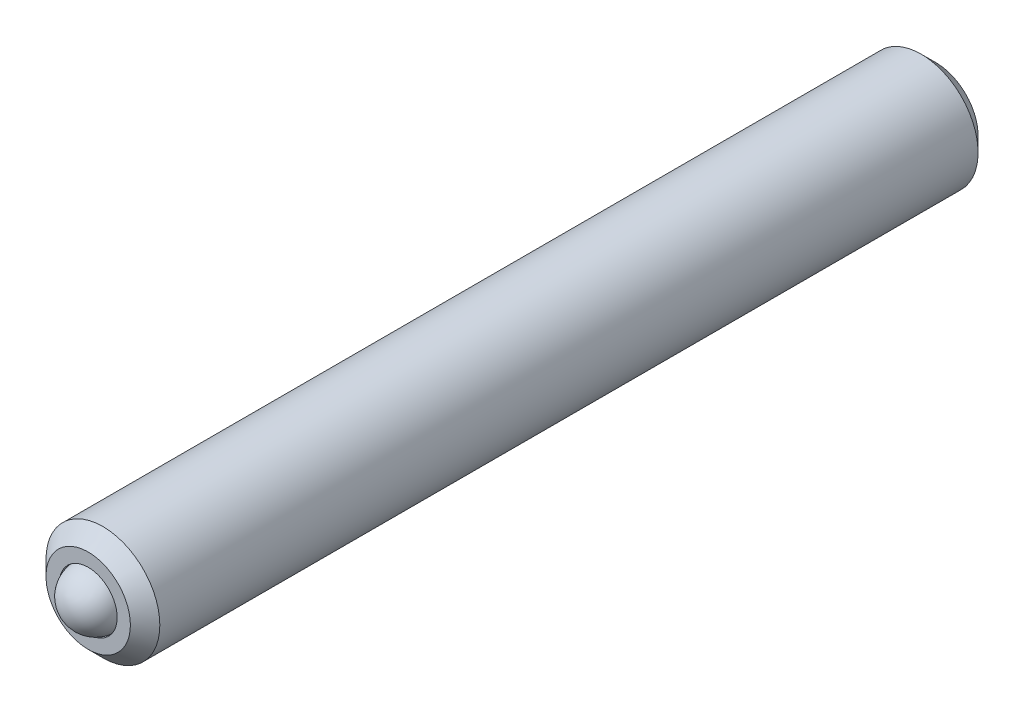
ISO-10303-21;
HEADER;
FILE_DESCRIPTION(('STEP AP214'),'2;1');
FILE_NAME('part.step','',(''),(''),'','','');
FILE_SCHEMA(('AUTOMOTIVE_DESIGN { 1 0 10303 214 1 1 1 1 }'));
ENDSEC;
DATA;
#1=APPLICATION_CONTEXT('core data for automotive mechanical design processes');
#2=APPLICATION_PROTOCOL_DEFINITION('international standard','automotive_design',2000,#1);
#3=PRODUCT_CONTEXT('',#1,'mechanical');
#4=PRODUCT('Part','Part','',(#3));
#5=PRODUCT_RELATED_PRODUCT_CATEGORY('part','',(#4));
#6=PRODUCT_DEFINITION_FORMATION('','',#4);
#7=PRODUCT_DEFINITION_CONTEXT('part definition',#1,'design');
#8=PRODUCT_DEFINITION('design','',#6,#7);
#9=PRODUCT_DEFINITION_SHAPE('','',#8);
#10=(LENGTH_UNIT() NAMED_UNIT(*) SI_UNIT(.MILLI.,.METRE.));
#11=(NAMED_UNIT(*) PLANE_ANGLE_UNIT() SI_UNIT($,.RADIAN.));
#12=(NAMED_UNIT(*) SI_UNIT($,.STERADIAN.) SOLID_ANGLE_UNIT());
#13=UNCERTAINTY_MEASURE_WITH_UNIT(LENGTH_MEASURE(1.E-05),#10,'distance_accuracy_value','');
#14=(GEOMETRIC_REPRESENTATION_CONTEXT(3) GLOBAL_UNCERTAINTY_ASSIGNED_CONTEXT((#13)) GLOBAL_UNIT_ASSIGNED_CONTEXT((#10,
#11,#12)) REPRESENTATION_CONTEXT('',''));
#15=CARTESIAN_POINT('',(0.,0.,0.));
#16=DIRECTION('',(0.,0.,1.));
#17=DIRECTION('',(1.,0.,0.));
#18=AXIS2_PLACEMENT_3D('',#15,#16,#17);
#19=CARTESIAN_POINT('',(-30.4343898565094,-20.338985797423,37.096003949472));
#20=DIRECTION('',(0.189520342345768,-0.689525578485639,-0.69902540472517));
#21=DIRECTION('',(0.0573888609944846,0.718489669689452,-0.693166006944439));
#22=AXIS2_PLACEMENT_3D('',#19,#20,#21);
#23=SPHERICAL_SURFACE('',#22,0.5);
#24=CARTESIAN_POINT('',(-30.3396296853365,-20.6837485866658,36.7464912471095));
#25=VERTEX_POINT('',#24);
#26=VERTEX_LOOP('',#25);
#27=FACE_BOUND('',#26,.T.);
#28=ADVANCED_FACE('P0_F11',(#27),#23,.T.);
#29=CLOSED_SHELL('',(#28));
#30=MANIFOLD_SOLID_BREP('P0_B1',#29);
#31=CARTESIAN_POINT('',(-30.4343898565094,-20.338985797423,37.223003949472));
#32=DIRECTION('',(0.,0.,-1.));
#33=DIRECTION('',(-1.,0.,0.));
#34=AXIS2_PLACEMENT_3D('',#31,#32,#33);
#35=CYLINDRICAL_SURFACE('',#34,0.982);
#36=CARTESIAN_POINT('',(-30.4343898565094,-20.338985797423,22.850003949472));
#37=DIRECTION('',(0.,0.,-1.));
#38=DIRECTION('',(-1.,0.,0.));
#39=AXIS2_PLACEMENT_3D('',#36,#37,#38);
#40=CIRCLE('',#39,0.982);
#41=CARTESIAN_POINT('',(-31.4163898565094,-20.338985797423,22.850003949472));
#42=VERTEX_POINT('',#41);
#43=EDGE_CURVE('P1_E205',#42,#42,#40,.F.);
#44=ORIENTED_EDGE('',*,*,#43,.T.);
#45=EDGE_LOOP('',(#44));
#46=FACE_BOUND('',#45,.T.);
#47=CARTESIAN_POINT('',(-30.4343898565094,-20.338985797423,36.969003949472));
#48=DIRECTION('',(0.,0.,1.));
#49=DIRECTION('',(1.,0.,0.));
#50=AXIS2_PLACEMENT_3D('',#47,#48,#49);
#51=CIRCLE('',#50,0.982);
#52=CARTESIAN_POINT('',(-29.4523898565094,-20.338985797423,36.969003949472));
#53=VERTEX_POINT('',#52);
#54=EDGE_CURVE('P1_E209',#53,#53,#51,.F.);
#55=ORIENTED_EDGE('',*,*,#54,.T.);
#56=EDGE_LOOP('',(#55));
#57=FACE_BOUND('',#56,.T.);
#58=ADVANCED_FACE('P1_F15',(#46,#57),#35,.T.);
#59=CARTESIAN_POINT('',(-30.4343898565094,-20.338985797423,37.223003949472));
#60=DIRECTION('',(0.,0.,1.));
#61=DIRECTION('',(1.,0.,0.));
#62=AXIS2_PLACEMENT_3D('',#59,#60,#61);
#63=PLANE('',#62);
#64=CARTESIAN_POINT('',(-30.4343898565094,-20.338985797423,37.223003949472));
#65=DIRECTION('',(0.,0.,1.));
#66=DIRECTION('',(1.,0.,0.));
#67=AXIS2_PLACEMENT_3D('',#64,#65,#66);
#68=CIRCLE('',#67,0.728000000000005);
#69=CARTESIAN_POINT('',(-29.7063898565094,-20.338985797423,37.223003949472));
#70=VERTEX_POINT('',#69);
#71=EDGE_CURVE('P1_E29',#70,#70,#68,.T.);
#72=ORIENTED_EDGE('',*,*,#71,.T.);
#73=EDGE_LOOP('',(#72));
#74=FACE_BOUND('',#73,.T.);
#75=CARTESIAN_POINT('',(-30.4343898565094,-20.338985797423,37.223003949472));
#76=DIRECTION('',(0.,0.,1.));
#77=DIRECTION('',(1.,0.,0.));
#78=AXIS2_PLACEMENT_3D('',#75,#76,#77);
#79=CIRCLE('',#78,0.5);
#80=CARTESIAN_POINT('',(-29.9343898565094,-20.338985797423,37.223003949472));
#81=VERTEX_POINT('',#80);
#82=EDGE_CURVE('P1_E210',#81,#81,#79,.T.);
#83=ORIENTED_EDGE('',*,*,#82,.F.);
#84=EDGE_LOOP('',(#83));
#85=FACE_BOUND('',#84,.T.);
#86=ADVANCED_FACE('P1_F181',(#74,#85),#63,.T.);
#87=CARTESIAN_POINT('',(-30.4343898565094,-20.338985797423,37.223003949472));
#88=DIRECTION('',(0.,0.,1.));
#89=DIRECTION('',(1.,0.,0.));
#90=AXIS2_PLACEMENT_3D('',#87,#88,#89);
#91=CYLINDRICAL_SURFACE('',#90,0.5);
#92=CARTESIAN_POINT('',(-30.4343898565094,-20.338985797423,36.8888971682855));
#93=DIRECTION('',(0.,0.,1.));
#94=DIRECTION('',(1.,0.,0.));
#95=AXIS2_PLACEMENT_3D('',#92,#93,#94);
#96=CIRCLE('',#95,0.5);
#97=CARTESIAN_POINT('',(-29.9343898565094,-20.338985797423,36.8888971682855));
#98=VERTEX_POINT('',#97);
#99=EDGE_CURVE('P1_E215',#98,#98,#96,.T.);
#100=ORIENTED_EDGE('',*,*,#99,.F.);
#101=EDGE_LOOP('',(#100));
#102=FACE_BOUND('',#101,.T.);
#103=ORIENTED_EDGE('',*,*,#82,.T.);
#104=EDGE_LOOP('',(#103));
#105=FACE_BOUND('',#104,.T.);
#106=ADVANCED_FACE('P1_F187',(#102,#105),#91,.F.);
#107=CARTESIAN_POINT('',(-30.4343898565094,-20.338985797423,36.8888971682855));
#108=DIRECTION('',(0.,0.,1.));
#109=DIRECTION('',(1.,0.,0.));
#110=AXIS2_PLACEMENT_3D('',#107,#108,#109);
#111=CONICAL_SURFACE('',#110,0.5,0.785398163397443);
#112=CARTESIAN_POINT('',(-30.4343898565094,-20.338985797423,36.3888971682855));
#113=VERTEX_POINT('',#112);
#114=VERTEX_LOOP('',#113);
#115=FACE_BOUND('',#114,.T.);
#116=ORIENTED_EDGE('',*,*,#99,.T.);
#117=EDGE_LOOP('',(#116));
#118=FACE_BOUND('',#117,.T.);
#119=ADVANCED_FACE('P1_F201',(#115,#118),#111,.F.);
#120=CARTESIAN_POINT('',(-30.4343898565094,-20.338985797423,22.596003949472));
#121=DIRECTION('',(0.,0.,-1.));
#122=DIRECTION('',(-1.,0.,0.));
#123=AXIS2_PLACEMENT_3D('',#120,#121,#122);
#124=PLANE('',#123);
#125=CARTESIAN_POINT('',(-30.4343898565094,-20.338985797423,22.596003949472));
#126=DIRECTION('',(0.,0.,-1.));
#127=DIRECTION('',(-1.,0.,0.));
#128=AXIS2_PLACEMENT_3D('',#125,#126,#127);
#129=CIRCLE('',#128,0.635);
#130=CARTESIAN_POINT('',(-30.9843159879125,-20.021485797423,22.596003949472));
#131=VERTEX_POINT('',#130);
#132=CARTESIAN_POINT('',(-30.4343898565094,-19.703985797423,22.596003949472));
#133=VERTEX_POINT('',#132);
#134=EDGE_CURVE('P1_E35',#131,#133,#129,.T.);
#135=ORIENTED_EDGE('',*,*,#134,.F.);
#136=CARTESIAN_POINT('',(-30.9843159879125,-20.656485797423,22.596003949472));
#137=VERTEX_POINT('',#136);
#138=EDGE_CURVE('P1_E42',#137,#131,#129,.T.);
#139=ORIENTED_EDGE('',*,*,#138,.F.);
#140=CARTESIAN_POINT('',(-30.4343898565094,-20.973985797423,22.596003949472));
#141=VERTEX_POINT('',#140);
#142=EDGE_CURVE('P1_E115',#141,#137,#129,.T.);
#143=ORIENTED_EDGE('',*,*,#142,.F.);
#144=CARTESIAN_POINT('',(-29.8844637251063,-20.656485797423,22.596003949472));
#145=VERTEX_POINT('',#144);
#146=EDGE_CURVE('P1_E114',#145,#141,#129,.T.);
#147=ORIENTED_EDGE('',*,*,#146,.F.);
#148=CARTESIAN_POINT('',(-29.8844637251063,-20.021485797423,22.596003949472));
#149=VERTEX_POINT('',#148);
#150=EDGE_CURVE('P1_E85',#149,#145,#129,.T.);
#151=ORIENTED_EDGE('',*,*,#150,.F.);
#152=EDGE_CURVE('P1_E77',#133,#149,#129,.T.);
#153=ORIENTED_EDGE('',*,*,#152,.F.);
#154=EDGE_LOOP('',(#135,#139,#143,#147,#151,#153));
#155=FACE_BOUND('',#154,.T.);
#156=CARTESIAN_POINT('',(-30.4343898565094,-20.338985797423,22.596003949472));
#157=DIRECTION('',(0.,0.,-1.));
#158=DIRECTION('',(-1.,0.,0.));
#159=AXIS2_PLACEMENT_3D('',#156,#157,#158);
#160=CIRCLE('',#159,0.728);
#161=CARTESIAN_POINT('',(-31.1623898565094,-20.338985797423,22.596003949472));
#162=VERTEX_POINT('',#161);
#163=EDGE_CURVE('P1_E208',#162,#162,#160,.T.);
#164=ORIENTED_EDGE('',*,*,#163,.T.);
#165=EDGE_LOOP('',(#164));
#166=FACE_BOUND('',#165,.T.);
#167=ADVANCED_FACE('P1_F111',(#155,#166),#124,.T.);
#168=CARTESIAN_POINT('',(-30.4343898565094,-20.338985797423,22.596003949472));
#169=DIRECTION('',(0.,0.,1.));
#170=DIRECTION('',(1.,0.,0.));
#171=AXIS2_PLACEMENT_3D('',#168,#169,#170);
#172=CONICAL_SURFACE('',#171,0.728,0.785398163397445);
#173=ORIENTED_EDGE('',*,*,#43,.F.);
#174=EDGE_LOOP('',(#173));
#175=FACE_BOUND('',#174,.T.);
#176=ORIENTED_EDGE('',*,*,#163,.F.);
#177=EDGE_LOOP('',(#176));
#178=FACE_BOUND('',#177,.T.);
#179=ADVANCED_FACE('P1_F193',(#175,#178),#172,.T.);
#180=CARTESIAN_POINT('',(-30.4343898565094,-20.338985797423,37.223003949472));
#181=DIRECTION('',(0.,0.,-1.));
#182=DIRECTION('',(-1.,0.,0.));
#183=AXIS2_PLACEMENT_3D('',#180,#181,#182);
#184=CONICAL_SURFACE('',#183,0.728000000000005,0.785398163397448);
#185=ORIENTED_EDGE('',*,*,#54,.F.);
#186=EDGE_LOOP('',(#185));
#187=FACE_BOUND('',#186,.T.);
#188=ORIENTED_EDGE('',*,*,#71,.F.);
#189=EDGE_LOOP('',(#188));
#190=FACE_BOUND('',#189,.T.);
#191=ADVANCED_FACE('P1_F17',(#187,#190),#184,.T.);
#192=CARTESIAN_POINT('',(-30.4343898565094,-20.338985797423,22.596003949472));
#193=DIRECTION('',(0.,0.,-1.));
#194=DIRECTION('',(-1.,0.,0.));
#195=AXIS2_PLACEMENT_3D('',#192,#193,#194);
#196=CONICAL_SURFACE('',#195,0.635,0.785398163397448);
#197=ORIENTED_EDGE('',*,*,#150,.T.);
#198=CARTESIAN_POINT('',(-29.8844637251063,-20.9722103874433,22.3923191866401));
#199=CARTESIAN_POINT('',(-29.8844637251063,-20.9413588695895,22.4155602531801));
#200=CARTESIAN_POINT('',(-29.8844637251063,-20.9101810750857,22.4384161057774));
#201=CARTESIAN_POINT('',(-29.8844637251063,-20.846636301244,22.482948148588));
#202=CARTESIAN_POINT('',(-29.8844637251063,-20.8142619449872,22.5046137509623));
#203=CARTESIAN_POINT('',(-29.8844637251063,-20.7463757114182,22.5471557085452));
#204=CARTESIAN_POINT('',(-29.8844637251063,-20.7107902234872,22.5679164281221));
#205=CARTESIAN_POINT('',(-29.8844637251063,-20.6378433391998,22.605890217127));
#206=CARTESIAN_POINT('',(-29.8844637251063,-20.60048847403,22.62311524641));
#207=CARTESIAN_POINT('',(-29.8844637251063,-20.5444128675768,22.6441870142195));
#208=CARTESIAN_POINT('',(-29.8844637251063,-20.5265252869018,22.6502345110006));
#209=CARTESIAN_POINT('',(-29.8844637251063,-20.4903278758701,22.6608973231525));
#210=CARTESIAN_POINT('',(-29.8844637251063,-20.4720180165175,22.6655125398591));
#211=CARTESIAN_POINT('',(-29.8844637251063,-20.4172218641305,22.6766647748571));
#212=CARTESIAN_POINT('',(-29.8844637251063,-20.3801867879268,22.6807826264189));
#213=CARTESIAN_POINT('',(-29.8844637251063,-20.3074004442862,22.6813317661946));
#214=CARTESIAN_POINT('',(-29.8844637251063,-20.2716511990384,22.6780357204014));
#215=CARTESIAN_POINT('',(-29.8844637251063,-20.2186530165783,22.6683468796217));
#216=CARTESIAN_POINT('',(-29.8844637251063,-20.2009333087625,22.6642670718709));
#217=CARTESIAN_POINT('',(-29.8844637251063,-20.1658731015379,22.6547190549548));
#218=CARTESIAN_POINT('',(-29.8844637251063,-20.148532570531,22.6492509619624));
#219=CARTESIAN_POINT('',(-29.8844637251063,-20.0939399529888,22.6299774619139));
#220=CARTESIAN_POINT('',(-29.8844637251063,-20.0574674372998,22.6139761741335));
#221=CARTESIAN_POINT('',(-29.8844637251063,-19.9862345468413,22.5783967683958));
#222=CARTESIAN_POINT('',(-29.8844637251063,-19.9514809120662,22.5588057998349));
#223=CARTESIAN_POINT('',(-29.8844637251063,-19.8850604966058,22.5183995247521));
#224=CARTESIAN_POINT('',(-29.8844637251063,-19.8533261412588,22.497693436675));
#225=CARTESIAN_POINT('',(-29.8844637251063,-19.7910819632868,22.4550338071794));
#226=CARTESIAN_POINT('',(-29.8844637251063,-19.7605642499931,22.4330918496065));
#227=CARTESIAN_POINT('',(-29.8844637251063,-19.7303815287162,22.4107491683899));
#228=B_SPLINE_CURVE_WITH_KNOTS('',3,(#198,#199,#200,#201,#202,#203,#204,#205,#206,#207,#208,
#209,#210,#211,#212,#213,#214,#215,#216,#217,#218,#219,#220,#221,#222,#223,#224,#225,#226,#227),
.UNSPECIFIED.,.F.,.F.,(4,2,2,2,2,2,2,2,2,2,2,2,2,2,4),(0.,0.115919377669939,0.232742618789012,
0.356233992025996,0.479300496450954,0.535894602508552,0.59249260624889,0.703511975702777,
0.810515319981278,0.86501602539473,0.919512171643778,1.03864987361044,1.15822271572585,
1.27185363992294,1.38455547987616),.UNSPECIFIED.);
#229=EDGE_CURVE('P1_E10',#149,#145,#228,.F.);
#230=ORIENTED_EDGE('',*,*,#229,.F.);
#231=EDGE_LOOP('',(#197,#230));
#232=FACE_BOUND('',#231,.T.);
#233=ADVANCED_FACE('P1_F89',(#232),#196,.F.);
#234=ORIENTED_EDGE('',*,*,#146,.T.);
#235=CARTESIAN_POINT('',(-29.8842637251063,-20.6563703273692,22.5958884479279));
#236=CARTESIAN_POINT('',(-29.9031778608525,-20.6672904087338,22.6068027688315));
#237=CARTESIAN_POINT('',(-29.9224070858241,-20.6783924069474,22.6170775123634));
#238=CARTESIAN_POINT('',(-29.9616181655074,-20.7010309343578,22.6358911642318));
#239=CARTESIAN_POINT('',(-29.981603757822,-20.7125696214605,22.6444195916482));
#240=CARTESIAN_POINT('',(-30.0219064091017,-20.7358383680259,22.6590273871859));
#241=CARTESIAN_POINT('',(-30.04221314143,-20.747562465402,22.6651435477441));
#242=CARTESIAN_POINT('',(-30.0832640883846,-20.7712632406767,22.6745746288571));
#243=CARTESIAN_POINT('',(-30.104007070391,-20.7832392069219,22.6778965758982));
#244=CARTESIAN_POINT('',(-30.154670405995,-20.812489697371,22.6821109616861));
#245=CARTESIAN_POINT('',(-30.184709084338,-20.8298325363984,22.6813490268982));
#246=CARTESIAN_POINT('',(-30.2441568582564,-20.8641547246729,22.6734949610485));
#247=CARTESIAN_POINT('',(-30.2735649461858,-20.8811334921553,22.6663933743563));
#248=CARTESIAN_POINT('',(-30.325217430474,-20.9109550678634,22.6492653575092));
#249=CARTESIAN_POINT('',(-30.3476990465095,-20.9239348349333,22.6401315280087));
#250=CARTESIAN_POINT('',(-30.3917811900643,-20.9493856723811,22.6195547302086));
#251=CARTESIAN_POINT('',(-30.4133843154253,-20.9618582426236,22.6081192722184));
#252=CARTESIAN_POINT('',(-30.4345898565094,-20.9741012674768,22.5958884479279));
#253=B_SPLINE_CURVE_WITH_KNOTS('',3,(#235,#236,#237,#238,#239,#240,#241,#242,#243,#244,#245,
#246,#247,#248,#249,#250,#251,#252),.UNSPECIFIED.,.F.,.F.,(4,2,2,2,2,2,2,2,4),(0.,
0.073295528608924,0.147018835182715,0.219569654599974,0.291937483545068,0.395361253462811,
0.498939538783555,0.581380863799343,0.663557417834381),.UNSPECIFIED.);
#254=EDGE_CURVE('P1_E117',#145,#141,#253,.T.);
#255=ORIENTED_EDGE('',*,*,#254,.F.);
#256=EDGE_LOOP('',(#234,#255));
#257=FACE_BOUND('',#256,.T.);
#258=ADVANCED_FACE('P1_F278',(#257),#196,.F.);
#259=ORIENTED_EDGE('',*,*,#142,.T.);
#260=CARTESIAN_POINT('',(-30.4341898565094,-20.9741012674768,22.5958884479279));
#261=CARTESIAN_POINT('',(-30.4531039922557,-20.9631811861122,22.6068027688315));
#262=CARTESIAN_POINT('',(-30.4723332172273,-20.9520791878986,22.6170775123634));
#263=CARTESIAN_POINT('',(-30.5115442969105,-20.9294406604882,22.6358911642318));
#264=CARTESIAN_POINT('',(-30.5315298892251,-20.9179019733855,22.6444195916482));
#265=CARTESIAN_POINT('',(-30.5718325405048,-20.8946332268201,22.6590273871859));
#266=CARTESIAN_POINT('',(-30.5921392728332,-20.8829091294439,22.6651435477441));
#267=CARTESIAN_POINT('',(-30.6331902197877,-20.8592083541693,22.6745746288571));
#268=CARTESIAN_POINT('',(-30.6539332017941,-20.8472323879241,22.6778965758982));
#269=CARTESIAN_POINT('',(-30.7045965373981,-20.817981897475,22.6821109616861));
#270=CARTESIAN_POINT('',(-30.7346352157411,-20.8006390584476,22.6813490268982));
#271=CARTESIAN_POINT('',(-30.7940829896596,-20.7663168701731,22.6734949610485));
#272=CARTESIAN_POINT('',(-30.8234910775889,-20.7493381026907,22.6663933743563));
#273=CARTESIAN_POINT('',(-30.8751435618772,-20.7195165269826,22.6492653575092));
#274=CARTESIAN_POINT('',(-30.8976251779126,-20.7065367599127,22.6401315280087));
#275=CARTESIAN_POINT('',(-30.9417073214674,-20.6810859224649,22.6195547302086));
#276=CARTESIAN_POINT('',(-30.9633104468284,-20.6686133522223,22.6081192722185));
#277=CARTESIAN_POINT('',(-30.9845159879125,-20.6563703273692,22.5958884479279));
#278=B_SPLINE_CURVE_WITH_KNOTS('',3,(#260,#261,#262,#263,#264,#265,#266,#267,#268,#269,#270,
#271,#272,#273,#274,#275,#276,#277),.UNSPECIFIED.,.F.,.F.,(4,2,2,2,2,2,2,2,4),(0.,
0.0732955286089255,0.147018835182714,0.219569654599969,0.291937483545064,0.395361253462813,
0.498939538783557,0.581380863799343,0.663557417834381),.UNSPECIFIED.);
#279=EDGE_CURVE('P1_E125',#141,#137,#278,.T.);
#280=ORIENTED_EDGE('',*,*,#279,.F.);
#281=EDGE_LOOP('',(#259,#280));
#282=FACE_BOUND('',#281,.T.);
#283=ADVANCED_FACE('P1_F275',(#282),#196,.F.);
#284=ORIENTED_EDGE('',*,*,#138,.T.);
#285=CARTESIAN_POINT('',(-30.9843159879125,-20.9722103873512,22.3923191867097));
#286=CARTESIAN_POINT('',(-30.9843159879125,-20.9413588695026,22.4155602532443));
#287=CARTESIAN_POINT('',(-30.9843159879125,-20.910181075004,22.4384161058362));
#288=CARTESIAN_POINT('',(-30.9843159879125,-20.8466363011729,22.4829481486362));
#289=CARTESIAN_POINT('',(-30.9843159879125,-20.8142619449216,22.5046137510052));
#290=CARTESIAN_POINT('',(-30.9843159879125,-20.7463757113645,22.5471557085771));
#291=CARTESIAN_POINT('',(-30.9843159879125,-20.7107902234399,22.5679164281484));
#292=CARTESIAN_POINT('',(-30.9843159879125,-20.637843339166,22.6058902171429));
#293=CARTESIAN_POINT('',(-30.9843159879125,-20.6004884740032,22.6231152464212));
#294=CARTESIAN_POINT('',(-30.9843159879125,-20.5444128675553,22.6441870142271));
#295=CARTESIAN_POINT('',(-30.9843159879125,-20.5265252868781,22.6502345110083));
#296=CARTESIAN_POINT('',(-30.9843159879125,-20.4903278758419,22.6608973231601));
#297=CARTESIAN_POINT('',(-30.9843159879125,-20.472018016487,22.6655125398664));
#298=CARTESIAN_POINT('',(-30.9843159879125,-20.4172218640933,22.6766647748626));
#299=CARTESIAN_POINT('',(-30.9843159879125,-20.3801867878852,22.6807826264223));
#300=CARTESIAN_POINT('',(-30.9843159879125,-20.3074004442367,22.681331766192));
#301=CARTESIAN_POINT('',(-30.9843159879125,-20.2716511989855,22.6780357203951));
#302=CARTESIAN_POINT('',(-30.9843159879125,-20.2186530165206,22.6683468796094));
#303=CARTESIAN_POINT('',(-30.9843159879125,-20.2009333087032,22.6642670718565));
#304=CARTESIAN_POINT('',(-30.9843159879125,-20.1658731014756,22.6547190549361));
#305=CARTESIAN_POINT('',(-30.9843159879125,-20.1485325704674,22.6492509619416));
#306=CARTESIAN_POINT('',(-30.9843159879125,-20.0939399529112,22.6299774618828));
#307=CARTESIAN_POINT('',(-30.9843159879125,-20.0574674372105,22.6139761740931));
#308=CARTESIAN_POINT('',(-30.9843159879125,-19.9862345467294,22.5783967683357));
#309=CARTESIAN_POINT('',(-30.9843159879125,-19.9514809119435,22.5588057997644));
#310=CARTESIAN_POINT('',(-30.9843159879125,-19.8850604964635,22.5183995246616));
#311=CARTESIAN_POINT('',(-30.9843159879125,-19.8533261411079,22.4976934365751));
#312=CARTESIAN_POINT('',(-30.9843159879125,-19.7910819631187,22.4550338070608));
#313=CARTESIAN_POINT('',(-30.9843159879125,-19.7605642498166,22.4330918494786));
#314=CARTESIAN_POINT('',(-30.9843159879125,-19.7303815285313,22.4107491682527));
#315=B_SPLINE_CURVE_WITH_KNOTS('',3,(#285,#286,#287,#288,#289,#290,#291,#292,#293,#294,#295,
#296,#297,#298,#299,#300,#301,#302,#303,#304,#305,#306,#307,#308,#309,#310,#311,#312,#313,#314),
.UNSPECIFIED.,.F.,.F.,(4,2,2,2,2,2,2,2,2,2,2,2,2,2,4),(0.,0.115919377647874,0.232742618744465,
0.356233991956238,0.479300496356226,0.535894602420216,0.59249260616693,0.703511975633006,
0.810515319922693,0.865016025342173,0.919512171597259,1.03864987360729,1.15822271576635,
1.27185364000079,1.38455547999085),.UNSPECIFIED.);
#316=EDGE_CURVE('P1_E145',#137,#131,#315,.T.);
#317=ORIENTED_EDGE('',*,*,#316,.F.);
#318=EDGE_LOOP('',(#284,#317));
#319=FACE_BOUND('',#318,.T.);
#320=ADVANCED_FACE('P1_F277',(#319),#196,.F.);
#321=ORIENTED_EDGE('',*,*,#134,.T.);
#322=CARTESIAN_POINT('',(-30.9845159879125,-20.0216012674768,22.5958884479279));
#323=CARTESIAN_POINT('',(-30.9656018521662,-20.0106811861122,22.6068027688315));
#324=CARTESIAN_POINT('',(-30.9463726271946,-19.9995791878986,22.6170775123634));
#325=CARTESIAN_POINT('',(-30.9071615475114,-19.9769406604882,22.6358911642318));
#326=CARTESIAN_POINT('',(-30.8871759551967,-19.9654019733855,22.6444195916482));
#327=CARTESIAN_POINT('',(-30.8468733039171,-19.9421332268201,22.6590273871859));
#328=CARTESIAN_POINT('',(-30.8265665715887,-19.9304091294439,22.6651435477441));
#329=CARTESIAN_POINT('',(-30.7855156246342,-19.9067083541693,22.6745746288571));
#330=CARTESIAN_POINT('',(-30.7647726426278,-19.8947323879241,22.6778965758982));
#331=CARTESIAN_POINT('',(-30.7141093070237,-19.865481897475,22.6821109616861));
#332=CARTESIAN_POINT('',(-30.6840706286807,-19.8481390584476,22.6813490268982));
#333=CARTESIAN_POINT('',(-30.6246228547623,-19.8138168701731,22.6734949610485));
#334=CARTESIAN_POINT('',(-30.5952147668329,-19.7968381026907,22.6663933743563));
#335=CARTESIAN_POINT('',(-30.5435622825447,-19.7670165269826,22.6492653575092));
#336=CARTESIAN_POINT('',(-30.5210806665093,-19.7540367599127,22.6401315280087));
#337=CARTESIAN_POINT('',(-30.4769985229545,-19.7285859224649,22.6195547302086));
#338=CARTESIAN_POINT('',(-30.4553953975934,-19.7161133522223,22.6081192722184));
#339=CARTESIAN_POINT('',(-30.4341898565094,-19.7038703273692,22.5958884479279));
#340=B_SPLINE_CURVE_WITH_KNOTS('',3,(#322,#323,#324,#325,#326,#327,#328,#329,#330,#331,#332,
#333,#334,#335,#336,#337,#338,#339),.UNSPECIFIED.,.F.,.F.,(4,2,2,2,2,2,2,2,4),(0.,
0.0732955286089224,0.147018835182714,0.219569654599972,0.291937483545067,0.395361253462806,
0.498939538783553,0.581380863799344,0.663557417834382),.UNSPECIFIED.);
#341=EDGE_CURVE('P1_E101',#131,#133,#340,.T.);
#342=ORIENTED_EDGE('',*,*,#341,.F.);
#343=EDGE_LOOP('',(#321,#342));
#344=FACE_BOUND('',#343,.T.);
#345=ADVANCED_FACE('P1_F138',(#344),#196,.F.);
#346=ORIENTED_EDGE('',*,*,#152,.T.);
#347=CARTESIAN_POINT('',(-30.4345898565094,-19.7038703273692,22.5958884479279));
#348=CARTESIAN_POINT('',(-30.4156757207631,-19.7147904087338,22.6068027688315));
#349=CARTESIAN_POINT('',(-30.3964464957915,-19.7258924069474,22.6170775123634));
#350=CARTESIAN_POINT('',(-30.3572354161083,-19.7485309343578,22.6358911642318));
#351=CARTESIAN_POINT('',(-30.3372498237936,-19.7600696214605,22.6444195916482));
#352=CARTESIAN_POINT('',(-30.2969471725139,-19.7833383680259,22.6590273871859));
#353=CARTESIAN_POINT('',(-30.2766404401856,-19.795062465402,22.6651435477441));
#354=CARTESIAN_POINT('',(-30.2355894932311,-19.8187632406767,22.6745746288571));
#355=CARTESIAN_POINT('',(-30.2148465112247,-19.8307392069219,22.6778965758982));
#356=CARTESIAN_POINT('',(-30.1641831756206,-19.859989697371,22.6821109616861));
#357=CARTESIAN_POINT('',(-30.1341444972776,-19.8773325363984,22.6813490268982));
#358=CARTESIAN_POINT('',(-30.0746967233592,-19.9116547246729,22.6734949610485));
#359=CARTESIAN_POINT('',(-30.0452886354298,-19.9286334921553,22.6663933743563));
#360=CARTESIAN_POINT('',(-29.9936361511416,-19.9584550678634,22.6492653575092));
#361=CARTESIAN_POINT('',(-29.9711545351061,-19.9714348349333,22.6401315280087));
#362=CARTESIAN_POINT('',(-29.9270723915513,-19.9968856723811,22.6195547302086));
#363=CARTESIAN_POINT('',(-29.9054692661903,-20.0093582426236,22.6081192722184));
#364=CARTESIAN_POINT('',(-29.8842637251063,-20.0216012674768,22.5958884479279));
#365=B_SPLINE_CURVE_WITH_KNOTS('',3,(#347,#348,#349,#350,#351,#352,#353,#354,#355,#356,#357,
#358,#359,#360,#361,#362,#363,#364),.UNSPECIFIED.,.F.,.F.,(4,2,2,2,2,2,2,2,4),(0.,
0.0732955286089255,0.147018835182714,0.219569654599969,0.291937483545064,0.39536125346281,
0.498939538783556,0.581380863799347,0.663557417834383),.UNSPECIFIED.);
#366=EDGE_CURVE('P1_E81',#133,#149,#365,.T.);
#367=ORIENTED_EDGE('',*,*,#366,.F.);
#368=EDGE_LOOP('',(#346,#367));
#369=FACE_BOUND('',#368,.T.);
#370=ADVANCED_FACE('P1_F79',(#369),#196,.F.);
#371=CARTESIAN_POINT('',(-30.4343898565094,-20.338985797423,24.628003949472));
#372=DIRECTION('',(0.,0.,1.));
#373=DIRECTION('',(1.,0.,0.));
#374=AXIS2_PLACEMENT_3D('',#371,#372,#373);
#375=PLANE('',#374);
#376=DIRECTION('',(0.866025403784439,-0.5,0.));
#377=VECTOR('',#376,1.);
#378=CARTESIAN_POINT('',(-29.8844637251063,-20.021485797423,24.628003949472));
#379=LINE('',#378,#377);
#380=CARTESIAN_POINT('',(-30.4343898565094,-19.703985797423,24.628003949472));
#381=VERTEX_POINT('',#380);
#382=CARTESIAN_POINT('',(-29.8844637251063,-20.021485797423,24.628003949472));
#383=VERTEX_POINT('',#382);
#384=EDGE_CURVE('P1_E100',#381,#383,#379,.T.);
#385=ORIENTED_EDGE('',*,*,#384,.T.);
#386=DIRECTION('',(0.,-1.,0.));
#387=VECTOR('',#386,1.);
#388=CARTESIAN_POINT('',(-29.8844637251063,-20.656485797423,24.628003949472));
#389=LINE('',#388,#387);
#390=CARTESIAN_POINT('',(-29.8844637251063,-20.656485797423,24.628003949472));
#391=VERTEX_POINT('',#390);
#392=EDGE_CURVE('P1_E105',#383,#391,#389,.T.);
#393=ORIENTED_EDGE('',*,*,#392,.T.);
#394=DIRECTION('',(-0.866025403784439,-0.5,0.));
#395=VECTOR('',#394,1.);
#396=CARTESIAN_POINT('',(-30.4343898565094,-20.973985797423,24.628003949472));
#397=LINE('',#396,#395);
#398=CARTESIAN_POINT('',(-30.4343898565094,-20.973985797423,24.628003949472));
#399=VERTEX_POINT('',#398);
#400=EDGE_CURVE('P1_E247',#391,#399,#397,.T.);
#401=ORIENTED_EDGE('',*,*,#400,.T.);
#402=DIRECTION('',(-0.866025403784439,0.5,0.));
#403=VECTOR('',#402,1.);
#404=CARTESIAN_POINT('',(-30.9843159879125,-20.656485797423,24.628003949472));
#405=LINE('',#404,#403);
#406=CARTESIAN_POINT('',(-30.9843159879125,-20.656485797423,24.628003949472));
#407=VERTEX_POINT('',#406);
#408=EDGE_CURVE('P1_E251',#399,#407,#405,.T.);
#409=ORIENTED_EDGE('',*,*,#408,.T.);
#410=DIRECTION('',(0.,1.,0.));
#411=VECTOR('',#410,1.);
#412=CARTESIAN_POINT('',(-30.9843159879125,-20.021485797423,24.628003949472));
#413=LINE('',#412,#411);
#414=CARTESIAN_POINT('',(-30.9843159879125,-20.021485797423,24.628003949472));
#415=VERTEX_POINT('',#414);
#416=EDGE_CURVE('P1_E254',#407,#415,#413,.T.);
#417=ORIENTED_EDGE('',*,*,#416,.T.);
#418=DIRECTION('',(0.866025403784439,0.5,0.));
#419=VECTOR('',#418,1.);
#420=CARTESIAN_POINT('',(-30.4343898565094,-19.703985797423,24.628003949472));
#421=LINE('',#420,#419);
#422=EDGE_CURVE('P1_E108',#415,#381,#421,.T.);
#423=ORIENTED_EDGE('',*,*,#422,.T.);
#424=EDGE_LOOP('',(#385,#393,#401,#409,#417,#423));
#425=FACE_BOUND('',#424,.T.);
#426=ADVANCED_FACE('P1_F137',(#425),#375,.F.);
#427=CARTESIAN_POINT('',(-29.8844637251063,-20.656485797423,24.628003949472));
#428=DIRECTION('',(1.,0.,0.));
#429=DIRECTION('',(0.,1.,0.));
#430=AXIS2_PLACEMENT_3D('',#427,#428,#429);
#431=PLANE('',#430);
#432=DIRECTION('',(0.,0.,-1.));
#433=VECTOR('',#432,1.);
#434=CARTESIAN_POINT('',(-29.8844637251063,-20.021485797423,24.628003949472));
#435=LINE('',#434,#433);
#436=EDGE_CURVE('P1_E97',#383,#149,#435,.T.);
#437=ORIENTED_EDGE('',*,*,#436,.T.);
#438=ORIENTED_EDGE('',*,*,#229,.T.);
#439=DIRECTION('',(0.,0.,-1.));
#440=VECTOR('',#439,1.);
#441=CARTESIAN_POINT('',(-29.8844637251063,-20.656485797423,24.628003949472));
#442=LINE('',#441,#440);
#443=EDGE_CURVE('P1_E107',#391,#145,#442,.T.);
#444=ORIENTED_EDGE('',*,*,#443,.F.);
#445=ORIENTED_EDGE('',*,*,#392,.F.);
#446=EDGE_LOOP('',(#437,#438,#444,#445));
#447=FACE_BOUND('',#446,.T.);
#448=ADVANCED_FACE('P1_F103',(#447),#431,.F.);
#449=CARTESIAN_POINT('',(-30.4343898565094,-20.973985797423,24.628003949472));
#450=DIRECTION('',(0.5,-0.866025403784439,0.));
#451=DIRECTION('',(0.866025403784439,0.5,0.));
#452=AXIS2_PLACEMENT_3D('',#449,#450,#451);
#453=PLANE('',#452);
#454=ORIENTED_EDGE('',*,*,#443,.T.);
#455=ORIENTED_EDGE('',*,*,#254,.T.);
#456=DIRECTION('',(0.,0.,-1.));
#457=VECTOR('',#456,1.);
#458=CARTESIAN_POINT('',(-30.4343898565094,-20.973985797423,24.628003949472));
#459=LINE('',#458,#457);
#460=EDGE_CURVE('P1_E263',#399,#141,#459,.T.);
#461=ORIENTED_EDGE('',*,*,#460,.F.);
#462=ORIENTED_EDGE('',*,*,#400,.F.);
#463=EDGE_LOOP('',(#454,#455,#461,#462));
#464=FACE_BOUND('',#463,.T.);
#465=ADVANCED_FACE('P1_F132',(#464),#453,.F.);
#466=CARTESIAN_POINT('',(-30.9843159879125,-20.656485797423,24.628003949472));
#467=DIRECTION('',(-0.5,-0.866025403784439,0.));
#468=DIRECTION('',(0.866025403784439,-0.5,0.));
#469=AXIS2_PLACEMENT_3D('',#466,#467,#468);
#470=PLANE('',#469);
#471=ORIENTED_EDGE('',*,*,#460,.T.);
#472=ORIENTED_EDGE('',*,*,#279,.T.);
#473=DIRECTION('',(0.,0.,-1.));
#474=VECTOR('',#473,1.);
#475=CARTESIAN_POINT('',(-30.9843159879125,-20.656485797423,24.628003949472));
#476=LINE('',#475,#474);
#477=EDGE_CURVE('P1_E261',#407,#137,#476,.T.);
#478=ORIENTED_EDGE('',*,*,#477,.F.);
#479=ORIENTED_EDGE('',*,*,#408,.F.);
#480=EDGE_LOOP('',(#471,#472,#478,#479));
#481=FACE_BOUND('',#480,.T.);
#482=ADVANCED_FACE('P1_F169',(#481),#470,.F.);
#483=CARTESIAN_POINT('',(-30.9843159879125,-20.021485797423,24.628003949472));
#484=DIRECTION('',(-1.,0.,0.));
#485=DIRECTION('',(0.,-1.,0.));
#486=AXIS2_PLACEMENT_3D('',#483,#484,#485);
#487=PLANE('',#486);
#488=ORIENTED_EDGE('',*,*,#477,.T.);
#489=ORIENTED_EDGE('',*,*,#316,.T.);
#490=DIRECTION('',(0.,0.,-1.));
#491=VECTOR('',#490,1.);
#492=CARTESIAN_POINT('',(-30.9843159879125,-20.021485797423,24.628003949472));
#493=LINE('',#492,#491);
#494=EDGE_CURVE('P1_E258',#415,#131,#493,.T.);
#495=ORIENTED_EDGE('',*,*,#494,.F.);
#496=ORIENTED_EDGE('',*,*,#416,.F.);
#497=EDGE_LOOP('',(#488,#489,#495,#496));
#498=FACE_BOUND('',#497,.T.);
#499=ADVANCED_FACE('P1_F165',(#498),#487,.F.);
#500=CARTESIAN_POINT('',(-30.4343898565094,-19.703985797423,24.628003949472));
#501=DIRECTION('',(-0.5,0.866025403784439,0.));
#502=DIRECTION('',(-0.866025403784439,-0.5,0.));
#503=AXIS2_PLACEMENT_3D('',#500,#501,#502);
#504=PLANE('',#503);
#505=ORIENTED_EDGE('',*,*,#494,.T.);
#506=ORIENTED_EDGE('',*,*,#341,.T.);
#507=DIRECTION('',(0.,0.,-1.));
#508=VECTOR('',#507,1.);
#509=CARTESIAN_POINT('',(-30.4343898565094,-19.703985797423,24.628003949472));
#510=LINE('',#509,#508);
#511=EDGE_CURVE('P1_E99',#381,#133,#510,.T.);
#512=ORIENTED_EDGE('',*,*,#511,.F.);
#513=ORIENTED_EDGE('',*,*,#422,.F.);
#514=EDGE_LOOP('',(#505,#506,#512,#513));
#515=FACE_BOUND('',#514,.T.);
#516=ADVANCED_FACE('P1_F162',(#515),#504,.F.);
#517=CARTESIAN_POINT('',(-29.8844637251063,-20.021485797423,24.628003949472));
#518=DIRECTION('',(0.5,0.866025403784439,0.));
#519=DIRECTION('',(-0.866025403784439,0.5,0.));
#520=AXIS2_PLACEMENT_3D('',#517,#518,#519);
#521=PLANE('',#520);
#522=ORIENTED_EDGE('',*,*,#511,.T.);
#523=ORIENTED_EDGE('',*,*,#366,.T.);
#524=ORIENTED_EDGE('',*,*,#436,.F.);
#525=ORIENTED_EDGE('',*,*,#384,.F.);
#526=EDGE_LOOP('',(#522,#523,#524,#525));
#527=FACE_BOUND('',#526,.T.);
#528=ADVANCED_FACE('P1_F95',(#527),#521,.F.);
#529=CLOSED_SHELL('',(#58,#86,#106,#119,#167,#179,#191,#233,#258,#283,#320,#345,#370,#426,#448,
#465,#482,#499,#516,#528));
#530=MANIFOLD_SOLID_BREP('P1_B1',#529);
#531=ADVANCED_BREP_SHAPE_REPRESENTATION('',(#18,#30,#530),#14);
#532=SHAPE_DEFINITION_REPRESENTATION(#9,#531);
ENDSEC;
END-ISO-10303-21;
